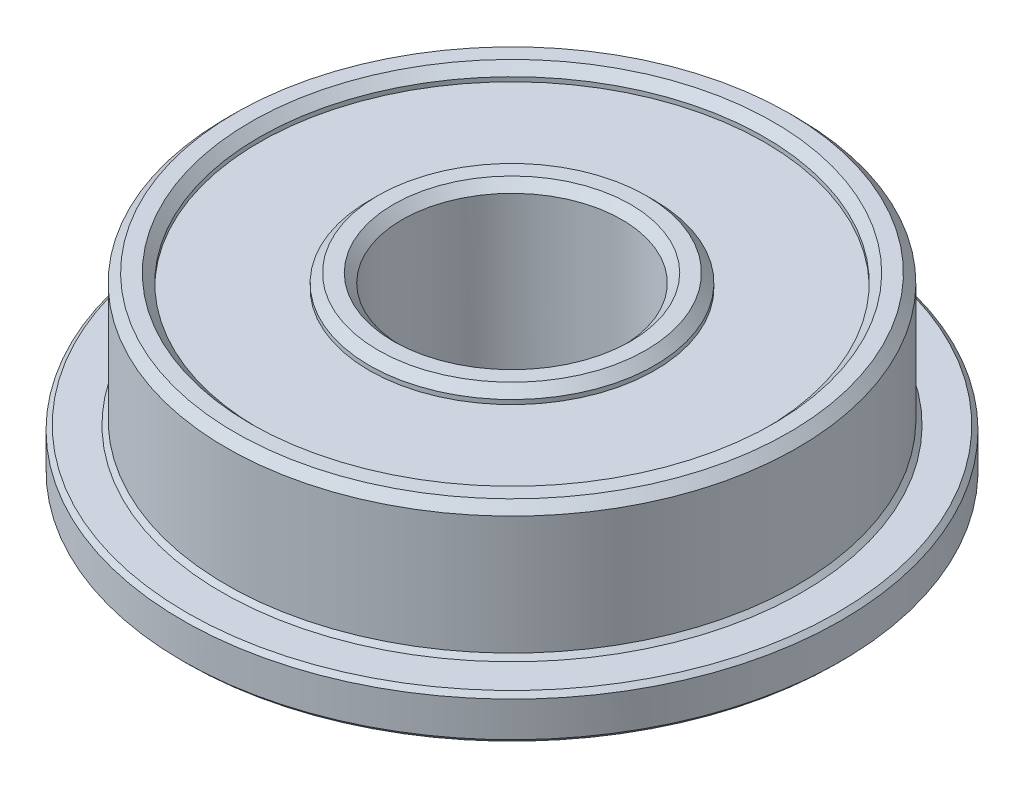
ISO-10303-21;
HEADER;
FILE_DESCRIPTION(('STEP AP214'),'2;1');
FILE_NAME('part.step','',(''),(''),'','','');
FILE_SCHEMA(('AUTOMOTIVE_DESIGN { 1 0 10303 214 1 1 1 1 }'));
ENDSEC;
DATA;
#1=APPLICATION_CONTEXT('core data for automotive mechanical design processes');
#2=APPLICATION_PROTOCOL_DEFINITION('international standard','automotive_design',2000,#1);
#3=PRODUCT_CONTEXT('',#1,'mechanical');
#4=PRODUCT('Part','Part','',(#3));
#5=PRODUCT_RELATED_PRODUCT_CATEGORY('part','',(#4));
#6=PRODUCT_DEFINITION_FORMATION('','',#4);
#7=PRODUCT_DEFINITION_CONTEXT('part definition',#1,'design');
#8=PRODUCT_DEFINITION('design','',#6,#7);
#9=PRODUCT_DEFINITION_SHAPE('','',#8);
#10=(LENGTH_UNIT() NAMED_UNIT(*) SI_UNIT(.MILLI.,.METRE.));
#11=(NAMED_UNIT(*) PLANE_ANGLE_UNIT() SI_UNIT($,.RADIAN.));
#12=(NAMED_UNIT(*) SI_UNIT($,.STERADIAN.) SOLID_ANGLE_UNIT());
#13=UNCERTAINTY_MEASURE_WITH_UNIT(LENGTH_MEASURE(1.E-05),#10,'distance_accuracy_value','');
#14=(GEOMETRIC_REPRESENTATION_CONTEXT(3) GLOBAL_UNCERTAINTY_ASSIGNED_CONTEXT((#13)) GLOBAL_UNIT_ASSIGNED_CONTEXT((#10,
#11,#12)) REPRESENTATION_CONTEXT('',''));
#15=CARTESIAN_POINT('',(0.,0.,0.));
#16=DIRECTION('',(0.,0.,1.));
#17=DIRECTION('',(1.,0.,0.));
#18=AXIS2_PLACEMENT_3D('',#15,#16,#17);
#19=CARTESIAN_POINT('',(0.,0.,0.));
#20=DIRECTION('',(0.,1.,0.));
#21=DIRECTION('',(0.,0.,1.));
#22=AXIS2_PLACEMENT_3D('',#19,#20,#21);
#23=PLANE('',#22);
#24=CARTESIAN_POINT('',(0.,0.,0.));
#25=DIRECTION('',(0.,-1.,0.));
#26=DIRECTION('',(0.,0.,-1.));
#27=AXIS2_PLACEMENT_3D('',#24,#25,#26);
#28=CIRCLE('',#27,2.69999999994752);
#29=CARTESIAN_POINT('',(0.,0.,-2.69999999994752));
#30=VERTEX_POINT('',#29);
#31=EDGE_CURVE('E18',#30,#30,#28,.F.);
#32=ORIENTED_EDGE('',*,*,#31,.T.);
#33=EDGE_LOOP('',(#32));
#34=FACE_BOUND('',#33,.T.);
#35=CARTESIAN_POINT('',(0.,-5.68433917557537E-11,0.));
#36=DIRECTION('',(0.,1.,0.));
#37=DIRECTION('',(0.,0.,1.));
#38=AXIS2_PLACEMENT_3D('',#35,#36,#37);
#39=CIRCLE('',#38,3.0500000000302);
#40=CARTESIAN_POINT('',(0.,-5.68427049553775E-11,3.0500000000302));
#41=VERTEX_POINT('',#40);
#42=EDGE_CURVE('E58',#41,#41,#39,.T.);
#43=ORIENTED_EDGE('',*,*,#42,.F.);
#44=EDGE_LOOP('',(#43));
#45=FACE_BOUND('',#44,.T.);
#46=ADVANCED_FACE('F15',(#34,#45),#23,.F.);
#47=CARTESIAN_POINT('',(0.,0.,0.));
#48=DIRECTION('',(0.,-1.,0.));
#49=DIRECTION('',(0.,0.,-1.));
#50=AXIS2_PLACEMENT_3D('',#47,#48,#49);
#51=CONICAL_SURFACE('',#50,2.69999999994752,0.785398163397448);
#52=CARTESIAN_POINT('',(0.,0.2,0.));
#53=DIRECTION('',(0.,1.,0.));
#54=DIRECTION('',(0.,0.,1.));
#55=AXIS2_PLACEMENT_3D('',#52,#53,#54);
#56=CIRCLE('',#55,2.5);
#57=CARTESIAN_POINT('',(0.,0.200000000000001,2.5));
#58=VERTEX_POINT('',#57);
#59=EDGE_CURVE('E55',#58,#58,#56,.T.);
#60=ORIENTED_EDGE('',*,*,#59,.T.);
#61=EDGE_LOOP('',(#60));
#62=FACE_BOUND('',#61,.T.);
#63=ORIENTED_EDGE('',*,*,#31,.F.);
#64=EDGE_LOOP('',(#63));
#65=FACE_BOUND('',#64,.T.);
#66=ADVANCED_FACE('F99',(#62,#65),#51,.F.);
#67=CARTESIAN_POINT('',(0.,0.199999999836109,0.));
#68=DIRECTION('',(0.,1.,0.));
#69=DIRECTION('',(0.,0.,1.));
#70=AXIS2_PLACEMENT_3D('',#67,#68,#69);
#71=CONICAL_SURFACE('',#70,3.24999999992315,0.785398163397448);
#72=CARTESIAN_POINT('',(0.,0.2,0.));
#73=DIRECTION('',(0.,-1.,0.));
#74=DIRECTION('',(0.,0.,-1.));
#75=AXIS2_PLACEMENT_3D('',#72,#73,#74);
#76=CIRCLE('',#75,3.25);
#77=CARTESIAN_POINT('',(0.,0.199999999999999,-3.25));
#78=VERTEX_POINT('',#77);
#79=EDGE_CURVE('E51',#78,#78,#76,.F.);
#80=ORIENTED_EDGE('',*,*,#79,.F.);
#81=EDGE_LOOP('',(#80));
#82=FACE_BOUND('',#81,.T.);
#83=ORIENTED_EDGE('',*,*,#42,.T.);
#84=EDGE_LOOP('',(#83));
#85=FACE_BOUND('',#84,.T.);
#86=ADVANCED_FACE('F101',(#82,#85),#71,.T.);
#87=CARTESIAN_POINT('',(0.,4.,0.));
#88=DIRECTION('',(0.,1.,0.));
#89=DIRECTION('',(0.,0.,1.));
#90=AXIS2_PLACEMENT_3D('',#87,#88,#89);
#91=CYLINDRICAL_SURFACE('',#90,2.5);
#92=ORIENTED_EDGE('',*,*,#59,.F.);
#93=EDGE_LOOP('',(#92));
#94=FACE_BOUND('',#93,.T.);
#95=CARTESIAN_POINT('',(0.,3.79999999995562,0.));
#96=DIRECTION('',(0.,1.,0.));
#97=DIRECTION('',(-1.,0.,0.));
#98=AXIS2_PLACEMENT_3D('',#95,#96,#97);
#99=CIRCLE('',#98,2.49999999994088);
#100=CARTESIAN_POINT('',(-2.49999999994088,3.79999999995562,0.));
#101=VERTEX_POINT('',#100);
#102=EDGE_CURVE('E54',#101,#101,#99,.T.);
#103=ORIENTED_EDGE('',*,*,#102,.T.);
#104=EDGE_LOOP('',(#103));
#105=FACE_BOUND('',#104,.T.);
#106=ADVANCED_FACE('F108',(#94,#105),#91,.F.);
#107=CARTESIAN_POINT('',(0.,0.,0.));
#108=DIRECTION('',(0.,-1.,0.));
#109=DIRECTION('',(0.,0.,-1.));
#110=AXIS2_PLACEMENT_3D('',#107,#108,#109);
#111=CYLINDRICAL_SURFACE('',#110,3.25);
#112=CARTESIAN_POINT('',(0.,0.3,0.));
#113=DIRECTION('',(0.,-1.,0.));
#114=DIRECTION('',(0.,0.,-1.));
#115=AXIS2_PLACEMENT_3D('',#112,#113,#114);
#116=CIRCLE('',#115,3.25);
#117=CARTESIAN_POINT('',(0.,0.299999999999999,-3.25));
#118=VERTEX_POINT('',#117);
#119=EDGE_CURVE('E61',#118,#118,#116,.T.);
#120=ORIENTED_EDGE('',*,*,#119,.T.);
#121=EDGE_LOOP('',(#120));
#122=FACE_BOUND('',#121,.T.);
#123=ORIENTED_EDGE('',*,*,#79,.T.);
#124=EDGE_LOOP('',(#123));
#125=FACE_BOUND('',#124,.T.);
#126=ADVANCED_FACE('F189',(#122,#125),#111,.T.);
#127=CARTESIAN_POINT('',(0.,4.0000000000191,0.));
#128=DIRECTION('',(0.,1.,0.));
#129=DIRECTION('',(0.,0.,1.));
#130=AXIS2_PLACEMENT_3D('',#127,#128,#129);
#131=CONICAL_SURFACE('',#130,2.70000000000437,0.785398163397448);
#132=ORIENTED_EDGE('',*,*,#102,.F.);
#133=EDGE_LOOP('',(#132));
#134=FACE_BOUND('',#133,.T.);
#135=CARTESIAN_POINT('',(0.,4.0000000000191,0.));
#136=DIRECTION('',(0.,1.,0.));
#137=DIRECTION('',(0.,0.,1.));
#138=AXIS2_PLACEMENT_3D('',#135,#136,#137);
#139=CIRCLE('',#138,2.70000000000437);
#140=CARTESIAN_POINT('',(0.,4.0000000000191,2.70000000000436));
#141=VERTEX_POINT('',#140);
#142=EDGE_CURVE('E87',#141,#141,#139,.T.);
#143=ORIENTED_EDGE('',*,*,#142,.T.);
#144=EDGE_LOOP('',(#143));
#145=FACE_BOUND('',#144,.T.);
#146=ADVANCED_FACE('F185',(#134,#145),#131,.F.);
#147=CARTESIAN_POINT('',(0.,0.3,0.));
#148=DIRECTION('',(0.,1.,0.));
#149=DIRECTION('',(0.,0.,1.));
#150=AXIS2_PLACEMENT_3D('',#147,#148,#149);
#151=PLANE('',#150);
#152=ORIENTED_EDGE('',*,*,#119,.F.);
#153=EDGE_LOOP('',(#152));
#154=FACE_BOUND('',#153,.T.);
#155=CARTESIAN_POINT('',(0.,0.3,0.));
#156=DIRECTION('',(0.,-1.,0.));
#157=DIRECTION('',(0.,0.,-1.));
#158=AXIS2_PLACEMENT_3D('',#155,#156,#157);
#159=CIRCLE('',#158,5.75);
#160=CARTESIAN_POINT('',(0.,0.299999999999999,-5.75));
#161=VERTEX_POINT('',#160);
#162=EDGE_CURVE('E84',#161,#161,#159,.T.);
#163=ORIENTED_EDGE('',*,*,#162,.T.);
#164=EDGE_LOOP('',(#163));
#165=FACE_BOUND('',#164,.T.);
#166=ADVANCED_FACE('F181',(#154,#165),#151,.F.);
#167=CARTESIAN_POINT('',(0.,4.,0.));
#168=DIRECTION('',(0.,-1.,0.));
#169=DIRECTION('',(0.,0.,-1.));
#170=AXIS2_PLACEMENT_3D('',#167,#168,#169);
#171=PLANE('',#170);
#172=ORIENTED_EDGE('',*,*,#142,.F.);
#173=EDGE_LOOP('',(#172));
#174=FACE_BOUND('',#173,.T.);
#175=CARTESIAN_POINT('',(0.,3.99999999996226,0.));
#176=DIRECTION('',(0.,-1.,0.));
#177=DIRECTION('',(0.,0.,-1.));
#178=AXIS2_PLACEMENT_3D('',#175,#176,#177);
#179=CIRCLE('',#178,3.0500000000302);
#180=CARTESIAN_POINT('',(0.,3.99999999996226,-3.0500000000302));
#181=VERTEX_POINT('',#180);
#182=EDGE_CURVE('E50',#181,#181,#179,.T.);
#183=ORIENTED_EDGE('',*,*,#182,.F.);
#184=EDGE_LOOP('',(#183));
#185=FACE_BOUND('',#184,.T.);
#186=ADVANCED_FACE('F177',(#174,#185),#171,.F.);
#187=CARTESIAN_POINT('',(0.,0.,0.));
#188=DIRECTION('',(0.,-1.,0.));
#189=DIRECTION('',(0.,0.,-1.));
#190=AXIS2_PLACEMENT_3D('',#187,#188,#189);
#191=CYLINDRICAL_SURFACE('',#190,5.75);
#192=ORIENTED_EDGE('',*,*,#162,.F.);
#193=EDGE_LOOP('',(#192));
#194=FACE_BOUND('',#193,.T.);
#195=CARTESIAN_POINT('',(0.,0.200000000006639,0.));
#196=DIRECTION('',(0.,-1.,0.));
#197=DIRECTION('',(1.,0.,0.));
#198=AXIS2_PLACEMENT_3D('',#195,#196,#197);
#199=CIRCLE('',#198,5.75000000003456);
#200=CARTESIAN_POINT('',(5.75000000003456,0.200000000006639,0.));
#201=VERTEX_POINT('',#200);
#202=EDGE_CURVE('E47',#201,#201,#199,.T.);
#203=ORIENTED_EDGE('',*,*,#202,.T.);
#204=EDGE_LOOP('',(#203));
#205=FACE_BOUND('',#204,.T.);
#206=ADVANCED_FACE('F173',(#194,#205),#191,.F.);
#207=CARTESIAN_POINT('',(0.,3.80000000001246,0.));
#208=DIRECTION('',(0.,-1.,0.));
#209=DIRECTION('',(0.,0.,-1.));
#210=AXIS2_PLACEMENT_3D('',#207,#208,#209);
#211=CONICAL_SURFACE('',#210,3.24999999997999,0.785398163397448);
#212=CARTESIAN_POINT('',(0.,3.8,0.));
#213=DIRECTION('',(0.,1.,0.));
#214=DIRECTION('',(0.,0.,1.));
#215=AXIS2_PLACEMENT_3D('',#212,#213,#214);
#216=CIRCLE('',#215,3.25);
#217=CARTESIAN_POINT('',(0.,3.8,3.25));
#218=VERTEX_POINT('',#217);
#219=EDGE_CURVE('E43',#218,#218,#216,.F.);
#220=ORIENTED_EDGE('',*,*,#219,.F.);
#221=EDGE_LOOP('',(#220));
#222=FACE_BOUND('',#221,.T.);
#223=ORIENTED_EDGE('',*,*,#182,.T.);
#224=EDGE_LOOP('',(#223));
#225=FACE_BOUND('',#224,.T.);
#226=ADVANCED_FACE('F169',(#222,#225),#211,.T.);
#227=CARTESIAN_POINT('',(0.,5.6843418860808E-11,0.));
#228=DIRECTION('',(0.,-1.,0.));
#229=DIRECTION('',(0.,0.,-1.));
#230=AXIS2_PLACEMENT_3D('',#227,#228,#229);
#231=CONICAL_SURFACE('',#230,5.94999999998436,0.785398163397448);
#232=ORIENTED_EDGE('',*,*,#202,.F.);
#233=EDGE_LOOP('',(#232));
#234=FACE_BOUND('',#233,.T.);
#235=CARTESIAN_POINT('',(0.,0.,0.));
#236=DIRECTION('',(0.,-1.,0.));
#237=DIRECTION('',(0.,0.,-1.));
#238=AXIS2_PLACEMENT_3D('',#235,#236,#237);
#239=CIRCLE('',#238,5.9500000000412);
#240=CARTESIAN_POINT('',(0.,0.,-5.9500000000412));
#241=VERTEX_POINT('',#240);
#242=EDGE_CURVE('E46',#241,#241,#239,.T.);
#243=ORIENTED_EDGE('',*,*,#242,.T.);
#244=EDGE_LOOP('',(#243));
#245=FACE_BOUND('',#244,.T.);
#246=ADVANCED_FACE('F165',(#234,#245),#231,.F.);
#247=CARTESIAN_POINT('',(0.,4.,0.));
#248=DIRECTION('',(0.,1.,0.));
#249=DIRECTION('',(0.,0.,1.));
#250=AXIS2_PLACEMENT_3D('',#247,#248,#249);
#251=CYLINDRICAL_SURFACE('',#250,3.25);
#252=CARTESIAN_POINT('',(0.,3.7,0.));
#253=DIRECTION('',(0.,1.,0.));
#254=DIRECTION('',(0.,0.,1.));
#255=AXIS2_PLACEMENT_3D('',#252,#253,#254);
#256=CIRCLE('',#255,3.25);
#257=CARTESIAN_POINT('',(0.,3.7,3.25));
#258=VERTEX_POINT('',#257);
#259=EDGE_CURVE('E77',#258,#258,#256,.T.);
#260=ORIENTED_EDGE('',*,*,#259,.T.);
#261=EDGE_LOOP('',(#260));
#262=FACE_BOUND('',#261,.T.);
#263=ORIENTED_EDGE('',*,*,#219,.T.);
#264=EDGE_LOOP('',(#263));
#265=FACE_BOUND('',#264,.T.);
#266=ADVANCED_FACE('F161',(#262,#265),#251,.T.);
#267=CARTESIAN_POINT('',(0.,0.,0.));
#268=DIRECTION('',(0.,1.,0.));
#269=DIRECTION('',(0.,0.,1.));
#270=AXIS2_PLACEMENT_3D('',#267,#268,#269);
#271=PLANE('',#270);
#272=ORIENTED_EDGE('',*,*,#242,.F.);
#273=EDGE_LOOP('',(#272));
#274=FACE_BOUND('',#273,.T.);
#275=CARTESIAN_POINT('',(0.,0.,0.));
#276=DIRECTION('',(0.,1.,0.));
#277=DIRECTION('',(0.,0.,1.));
#278=AXIS2_PLACEMENT_3D('',#275,#276,#277);
#279=CIRCLE('',#278,7.4);
#280=CARTESIAN_POINT('',(0.,0.,7.4));
#281=VERTEX_POINT('',#280);
#282=EDGE_CURVE('E74',#281,#281,#279,.T.);
#283=ORIENTED_EDGE('',*,*,#282,.F.);
#284=EDGE_LOOP('',(#283));
#285=FACE_BOUND('',#284,.T.);
#286=ADVANCED_FACE('F157',(#274,#285),#271,.F.);
#287=CARTESIAN_POINT('',(0.,3.7,0.));
#288=DIRECTION('',(0.,-1.,0.));
#289=DIRECTION('',(0.,0.,-1.));
#290=AXIS2_PLACEMENT_3D('',#287,#288,#289);
#291=PLANE('',#290);
#292=ORIENTED_EDGE('',*,*,#259,.F.);
#293=EDGE_LOOP('',(#292));
#294=FACE_BOUND('',#293,.T.);
#295=CARTESIAN_POINT('',(0.,3.7,0.));
#296=DIRECTION('',(0.,1.,0.));
#297=DIRECTION('',(0.,0.,1.));
#298=AXIS2_PLACEMENT_3D('',#295,#296,#297);
#299=CIRCLE('',#298,5.75);
#300=CARTESIAN_POINT('',(0.,3.7,5.75));
#301=VERTEX_POINT('',#300);
#302=EDGE_CURVE('E36',#301,#301,#299,.T.);
#303=ORIENTED_EDGE('',*,*,#302,.T.);
#304=EDGE_LOOP('',(#303));
#305=FACE_BOUND('',#304,.T.);
#306=ADVANCED_FACE('F153',(#294,#305),#291,.F.);
#307=CARTESIAN_POINT('',(0.,0.100000000000001,0.));
#308=DIRECTION('',(0.,1.,0.));
#309=DIRECTION('',(0.,0.,1.));
#310=AXIS2_PLACEMENT_3D('',#307,#308,#309);
#311=CONICAL_SURFACE('',#310,7.5,0.785398163397449);
#312=ORIENTED_EDGE('',*,*,#282,.T.);
#313=EDGE_LOOP('',(#312));
#314=FACE_BOUND('',#313,.T.);
#315=CARTESIAN_POINT('',(0.,0.1,0.));
#316=DIRECTION('',(0.,-1.,0.));
#317=DIRECTION('',(0.,0.,-1.));
#318=AXIS2_PLACEMENT_3D('',#315,#316,#317);
#319=CIRCLE('',#318,7.5);
#320=CARTESIAN_POINT('',(0.,0.1,-7.5));
#321=VERTEX_POINT('',#320);
#322=EDGE_CURVE('E32',#321,#321,#319,.F.);
#323=ORIENTED_EDGE('',*,*,#322,.F.);
#324=EDGE_LOOP('',(#323));
#325=FACE_BOUND('',#324,.T.);
#326=ADVANCED_FACE('F149',(#314,#325),#311,.T.);
#327=CARTESIAN_POINT('',(0.,4.,0.));
#328=DIRECTION('',(0.,1.,0.));
#329=DIRECTION('',(0.,0.,1.));
#330=AXIS2_PLACEMENT_3D('',#327,#328,#329);
#331=CYLINDRICAL_SURFACE('',#330,5.75);
#332=ORIENTED_EDGE('',*,*,#302,.F.);
#333=EDGE_LOOP('',(#332));
#334=FACE_BOUND('',#333,.T.);
#335=CARTESIAN_POINT('',(0.,3.79999999995562,0.));
#336=DIRECTION('',(0.,1.,0.));
#337=DIRECTION('',(-1.,0.,0.));
#338=AXIS2_PLACEMENT_3D('',#335,#336,#337);
#339=CIRCLE('',#338,5.74999999992087);
#340=CARTESIAN_POINT('',(-5.74999999992087,3.79999999995562,0.));
#341=VERTEX_POINT('',#340);
#342=EDGE_CURVE('E35',#341,#341,#339,.T.);
#343=ORIENTED_EDGE('',*,*,#342,.T.);
#344=EDGE_LOOP('',(#343));
#345=FACE_BOUND('',#344,.T.);
#346=ADVANCED_FACE('F145',(#334,#345),#331,.F.);
#347=CARTESIAN_POINT('',(0.,0.,0.));
#348=DIRECTION('',(0.,-1.,0.));
#349=DIRECTION('',(0.,0.,-1.));
#350=AXIS2_PLACEMENT_3D('',#347,#348,#349);
#351=CYLINDRICAL_SURFACE('',#350,7.5);
#352=ORIENTED_EDGE('',*,*,#322,.T.);
#353=EDGE_LOOP('',(#352));
#354=FACE_BOUND('',#353,.T.);
#355=CARTESIAN_POINT('',(0.,0.9,0.));
#356=DIRECTION('',(0.,-1.,0.));
#357=DIRECTION('',(1.,0.,0.));
#358=AXIS2_PLACEMENT_3D('',#355,#356,#357);
#359=CIRCLE('',#358,7.5);
#360=CARTESIAN_POINT('',(7.5,0.9,0.));
#361=VERTEX_POINT('',#360);
#362=EDGE_CURVE('E37',#361,#361,#359,.F.);
#363=ORIENTED_EDGE('',*,*,#362,.F.);
#364=EDGE_LOOP('',(#363));
#365=FACE_BOUND('',#364,.T.);
#366=ADVANCED_FACE('F141',(#354,#365),#351,.T.);
#367=CARTESIAN_POINT('',(0.,3.99999999990541,0.));
#368=DIRECTION('',(0.,1.,0.));
#369=DIRECTION('',(0.,0.,1.));
#370=AXIS2_PLACEMENT_3D('',#367,#368,#369);
#371=CONICAL_SURFACE('',#370,5.94999999987067,0.785398163397448);
#372=ORIENTED_EDGE('',*,*,#342,.F.);
#373=EDGE_LOOP('',(#372));
#374=FACE_BOUND('',#373,.T.);
#375=CARTESIAN_POINT('',(0.,3.99999999996226,0.));
#376=DIRECTION('',(0.,1.,0.));
#377=DIRECTION('',(0.,0.,1.));
#378=AXIS2_PLACEMENT_3D('',#375,#376,#377);
#379=CIRCLE('',#378,5.94999999992751);
#380=CARTESIAN_POINT('',(0.,3.99999999996226,5.94999999992751));
#381=VERTEX_POINT('',#380);
#382=EDGE_CURVE('E40',#381,#381,#379,.T.);
#383=ORIENTED_EDGE('',*,*,#382,.T.);
#384=EDGE_LOOP('',(#383));
#385=FACE_BOUND('',#384,.T.);
#386=ADVANCED_FACE('F137',(#374,#385),#371,.F.);
#387=CARTESIAN_POINT('',(0.,0.899999999999999,0.));
#388=DIRECTION('',(0.,-1.,0.));
#389=DIRECTION('',(0.,0.,-1.));
#390=AXIS2_PLACEMENT_3D('',#387,#388,#389);
#391=CONICAL_SURFACE('',#390,7.5,0.785398163397447);
#392=ORIENTED_EDGE('',*,*,#362,.T.);
#393=EDGE_LOOP('',(#392));
#394=FACE_BOUND('',#393,.T.);
#395=CARTESIAN_POINT('',(0.,1.,0.));
#396=DIRECTION('',(0.,-1.,0.));
#397=DIRECTION('',(0.,0.,-1.));
#398=AXIS2_PLACEMENT_3D('',#395,#396,#397);
#399=CIRCLE('',#398,7.4);
#400=CARTESIAN_POINT('',(0.,1.,-7.4));
#401=VERTEX_POINT('',#400);
#402=EDGE_CURVE('E67',#401,#401,#399,.T.);
#403=ORIENTED_EDGE('',*,*,#402,.T.);
#404=EDGE_LOOP('',(#403));
#405=FACE_BOUND('',#404,.T.);
#406=ADVANCED_FACE('F133',(#394,#405),#391,.T.);
#407=CARTESIAN_POINT('',(0.,4.,0.));
#408=DIRECTION('',(0.,-1.,0.));
#409=DIRECTION('',(0.,0.,-1.));
#410=AXIS2_PLACEMENT_3D('',#407,#408,#409);
#411=PLANE('',#410);
#412=ORIENTED_EDGE('',*,*,#382,.F.);
#413=EDGE_LOOP('',(#412));
#414=FACE_BOUND('',#413,.T.);
#415=CARTESIAN_POINT('',(0.,4.0000000000191,0.));
#416=DIRECTION('',(0.,-1.,0.));
#417=DIRECTION('',(0.,0.,-1.));
#418=AXIS2_PLACEMENT_3D('',#415,#416,#417);
#419=CIRCLE('',#418,6.29999999995334);
#420=CARTESIAN_POINT('',(0.,4.0000000000191,-6.29999999995334));
#421=VERTEX_POINT('',#420);
#422=EDGE_CURVE('E64',#421,#421,#419,.T.);
#423=ORIENTED_EDGE('',*,*,#422,.F.);
#424=EDGE_LOOP('',(#423));
#425=FACE_BOUND('',#424,.T.);
#426=ADVANCED_FACE('F129',(#414,#425),#411,.F.);
#427=CARTESIAN_POINT('',(0.,1.,0.));
#428=DIRECTION('',(0.,-1.,0.));
#429=DIRECTION('',(0.,0.,-1.));
#430=AXIS2_PLACEMENT_3D('',#427,#428,#429);
#431=PLANE('',#430);
#432=CARTESIAN_POINT('',(0.,1.0000000000332,0.));
#433=DIRECTION('',(0.,-1.,0.));
#434=DIRECTION('',(0.,0.,-1.));
#435=AXIS2_PLACEMENT_3D('',#432,#433,#434);
#436=CIRCLE('',#435,6.59999999999172);
#437=CARTESIAN_POINT('',(0.,1.0000000000332,-6.59999999999172));
#438=VERTEX_POINT('',#437);
#439=EDGE_CURVE('E27',#438,#438,#436,.F.);
#440=ORIENTED_EDGE('',*,*,#439,.F.);
#441=EDGE_LOOP('',(#440));
#442=FACE_BOUND('',#441,.T.);
#443=ORIENTED_EDGE('',*,*,#402,.F.);
#444=EDGE_LOOP('',(#443));
#445=FACE_BOUND('',#444,.T.);
#446=ADVANCED_FACE('F125',(#442,#445),#431,.F.);
#447=CARTESIAN_POINT('',(0.,3.79999999995562,0.));
#448=DIRECTION('',(0.,-1.,0.));
#449=DIRECTION('',(0.,0.,-1.));
#450=AXIS2_PLACEMENT_3D('',#447,#448,#449);
#451=CONICAL_SURFACE('',#450,6.50000000001683,0.785398163397448);
#452=CARTESIAN_POINT('',(0.,3.8,0.));
#453=DIRECTION('',(0.,-1.,0.));
#454=DIRECTION('',(0.,0.,-1.));
#455=AXIS2_PLACEMENT_3D('',#452,#453,#454);
#456=CIRCLE('',#455,6.5);
#457=CARTESIAN_POINT('',(0.,3.8,-6.5));
#458=VERTEX_POINT('',#457);
#459=EDGE_CURVE('E22',#458,#458,#456,.T.);
#460=ORIENTED_EDGE('',*,*,#459,.F.);
#461=EDGE_LOOP('',(#460));
#462=FACE_BOUND('',#461,.T.);
#463=ORIENTED_EDGE('',*,*,#422,.T.);
#464=EDGE_LOOP('',(#463));
#465=FACE_BOUND('',#464,.T.);
#466=ADVANCED_FACE('F118',(#462,#465),#451,.T.);
#467=CARTESIAN_POINT('',(0.,1.0000000000332,0.));
#468=DIRECTION('',(0.,-1.,0.));
#469=DIRECTION('',(0.,0.,-1.));
#470=AXIS2_PLACEMENT_3D('',#467,#468,#469);
#471=CONICAL_SURFACE('',#470,6.59999999999172,0.785398163397448);
#472=ORIENTED_EDGE('',*,*,#439,.T.);
#473=EDGE_LOOP('',(#472));
#474=FACE_BOUND('',#473,.T.);
#475=CARTESIAN_POINT('',(0.,1.1,0.));
#476=DIRECTION('',(0.,-1.,0.));
#477=DIRECTION('',(0.,0.,-1.));
#478=AXIS2_PLACEMENT_3D('',#475,#476,#477);
#479=CIRCLE('',#478,6.5);
#480=CARTESIAN_POINT('',(0.,1.1,-6.5));
#481=VERTEX_POINT('',#480);
#482=EDGE_CURVE('E10',#481,#481,#479,.F.);
#483=ORIENTED_EDGE('',*,*,#482,.F.);
#484=EDGE_LOOP('',(#483));
#485=FACE_BOUND('',#484,.T.);
#486=ADVANCED_FACE('F113',(#474,#485),#471,.T.);
#487=CARTESIAN_POINT('',(0.,2.,0.));
#488=DIRECTION('',(0.,-1.,0.));
#489=DIRECTION('',(0.,0.,-1.));
#490=AXIS2_PLACEMENT_3D('',#487,#488,#489);
#491=CYLINDRICAL_SURFACE('',#490,6.5);
#492=ORIENTED_EDGE('',*,*,#482,.T.);
#493=EDGE_LOOP('',(#492));
#494=FACE_BOUND('',#493,.T.);
#495=ORIENTED_EDGE('',*,*,#459,.T.);
#496=EDGE_LOOP('',(#495));
#497=FACE_BOUND('',#496,.T.);
#498=ADVANCED_FACE('F111',(#494,#497),#491,.T.);
#499=CLOSED_SHELL('',(#46,#66,#86,#106,#126,#146,#166,#186,#206,#226,#246,#266,#286,#306,#326,
#346,#366,#386,#406,#426,#446,#466,#486,#498));
#500=MANIFOLD_SOLID_BREP('B1',#499);
#501=ADVANCED_BREP_SHAPE_REPRESENTATION('',(#18,#500),#14);
#502=SHAPE_DEFINITION_REPRESENTATION(#9,#501);
ENDSEC;
END-ISO-10303-21;
